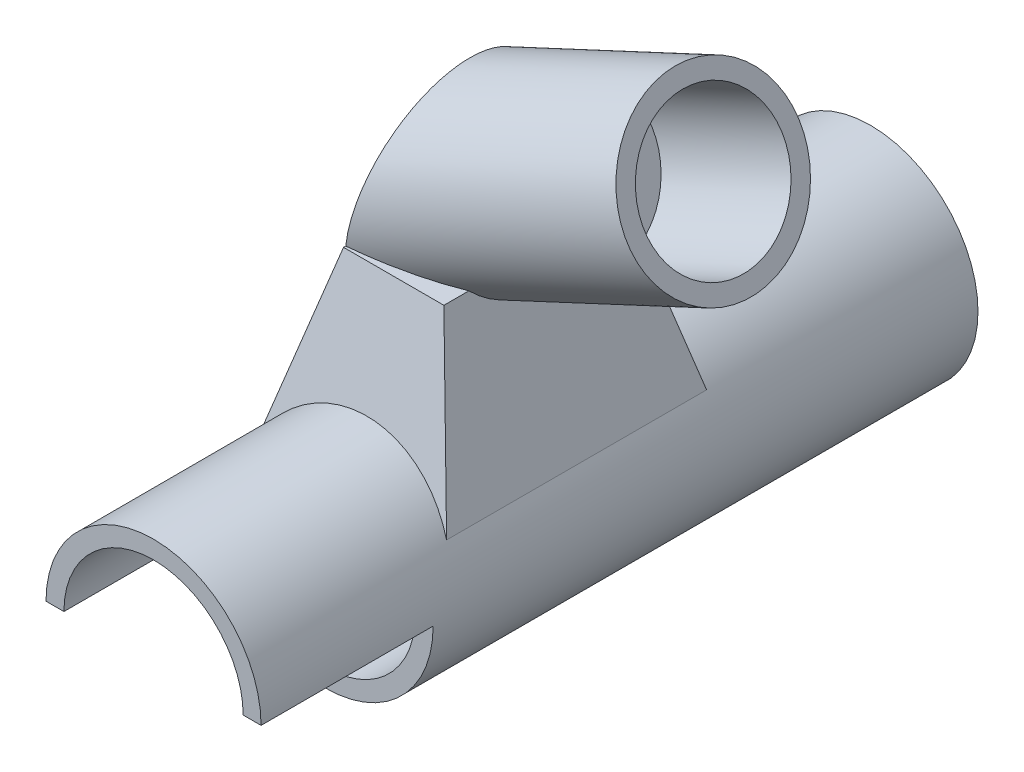
ISO-10303-21;
HEADER;
FILE_DESCRIPTION(('STEP AP214'),'2;1');
FILE_NAME('part.step','',(''),(''),'','','');
FILE_SCHEMA(('AUTOMOTIVE_DESIGN { 1 0 10303 214 1 1 1 1 }'));
ENDSEC;
DATA;
#1=APPLICATION_CONTEXT('core data for automotive mechanical design processes');
#2=APPLICATION_PROTOCOL_DEFINITION('international standard','automotive_design',2000,#1);
#3=PRODUCT_CONTEXT('',#1,'mechanical');
#4=PRODUCT('Part','Part','',(#3));
#5=PRODUCT_RELATED_PRODUCT_CATEGORY('part','',(#4));
#6=PRODUCT_DEFINITION_FORMATION('','',#4);
#7=PRODUCT_DEFINITION_CONTEXT('part definition',#1,'design');
#8=PRODUCT_DEFINITION('design','',#6,#7);
#9=PRODUCT_DEFINITION_SHAPE('','',#8);
#10=(LENGTH_UNIT() NAMED_UNIT(*) SI_UNIT(.MILLI.,.METRE.));
#11=(NAMED_UNIT(*) PLANE_ANGLE_UNIT() SI_UNIT($,.RADIAN.));
#12=(NAMED_UNIT(*) SI_UNIT($,.STERADIAN.) SOLID_ANGLE_UNIT());
#13=UNCERTAINTY_MEASURE_WITH_UNIT(LENGTH_MEASURE(1.E-05),#10,'distance_accuracy_value','');
#14=(GEOMETRIC_REPRESENTATION_CONTEXT(3) GLOBAL_UNCERTAINTY_ASSIGNED_CONTEXT((#13)) GLOBAL_UNIT_ASSIGNED_CONTEXT((#10,
#11,#12)) REPRESENTATION_CONTEXT('',''));
#15=CARTESIAN_POINT('',(0.,0.,0.));
#16=DIRECTION('',(0.,0.,1.));
#17=DIRECTION('',(1.,0.,0.));
#18=AXIS2_PLACEMENT_3D('',#15,#16,#17);
#19=CARTESIAN_POINT('',(0.,0.,154.));
#20=DIRECTION('',(0.,0.,-1.));
#21=DIRECTION('',(1.,0.,0.));
#22=AXIS2_PLACEMENT_3D('',#19,#20,#21);
#23=CYLINDRICAL_SURFACE('',#22,15.);
#24=CARTESIAN_POINT('',(0.,0.,54.));
#25=DIRECTION('',(0.,0.,1.));
#26=DIRECTION('',(1.,0.,0.));
#27=AXIS2_PLACEMENT_3D('',#24,#25,#26);
#28=CIRCLE('',#27,15.);
#29=CARTESIAN_POINT('',(15.,0.,54.));
#30=VERTEX_POINT('',#29);
#31=EDGE_CURVE('E327',#30,#30,#28,.T.);
#32=ORIENTED_EDGE('',*,*,#31,.T.);
#33=EDGE_LOOP('',(#32));
#34=FACE_BOUND('',#33,.T.);
#35=CARTESIAN_POINT('',(0.,0.,88.));
#36=DIRECTION('',(0.,0.242535625036333,-0.970142500145332));
#37=DIRECTION('',(0.,-0.970142500145332,-0.242535625036333));
#38=AXIS2_PLACEMENT_3D('',#35,#36,#37);
#39=ELLIPSE('',#38,15.4616460960662,15.);
#40=CARTESIAN_POINT('',(13.0082987551867,7.4688796680498,89.8672199170124));
#41=VERTEX_POINT('',#40);
#42=CARTESIAN_POINT('',(-13.0082987551867,7.4688796680498,89.8672199170124));
#43=VERTEX_POINT('',#42);
#44=EDGE_CURVE('E365',#41,#43,#39,.F.);
#45=ORIENTED_EDGE('',*,*,#44,.F.);
#46=DIRECTION('',(0.,0.,-1.));
#47=VECTOR('',#46,1.);
#48=CARTESIAN_POINT('',(13.0082987551867,7.4688796680498,154.));
#49=LINE('',#48,#47);
#50=CARTESIAN_POINT('',(13.0082987551867,7.4688796680498,126.132780082988));
#51=VERTEX_POINT('',#50);
#52=EDGE_CURVE('E369',#51,#41,#49,.T.);
#53=ORIENTED_EDGE('',*,*,#52,.F.);
#54=CARTESIAN_POINT('',(0.,0.,128.));
#55=DIRECTION('',(0.,0.242535625036333,0.970142500145332));
#56=DIRECTION('',(0.,0.970142500145332,-0.242535625036333));
#57=AXIS2_PLACEMENT_3D('',#54,#55,#56);
#58=ELLIPSE('',#57,15.4616460960662,15.);
#59=CARTESIAN_POINT('',(-13.0082987551867,7.46887966804979,126.132780082988));
#60=VERTEX_POINT('',#59);
#61=EDGE_CURVE('E375',#60,#51,#58,.F.);
#62=ORIENTED_EDGE('',*,*,#61,.F.);
#63=DIRECTION('',(0.,0.,-1.));
#64=VECTOR('',#63,1.);
#65=CARTESIAN_POINT('',(-13.0082987551867,7.46887966804975,154.));
#66=LINE('',#65,#64);
#67=EDGE_CURVE('E57',#43,#60,#66,.F.);
#68=ORIENTED_EDGE('',*,*,#67,.F.);
#69=EDGE_LOOP('',(#45,#53,#62,#68));
#70=FACE_BOUND('',#69,.T.);
#71=CARTESIAN_POINT('',(0.,0.,154.));
#72=DIRECTION('',(0.,0.,1.));
#73=DIRECTION('',(1.,0.,0.));
#74=AXIS2_PLACEMENT_3D('',#71,#72,#73);
#75=CIRCLE('',#74,15.);
#76=CARTESIAN_POINT('',(15.,0.,154.));
#77=VERTEX_POINT('',#76);
#78=CARTESIAN_POINT('',(-15.,0.,154.));
#79=VERTEX_POINT('',#78);
#80=EDGE_CURVE('E329',#77,#79,#75,.T.);
#81=ORIENTED_EDGE('',*,*,#80,.F.);
#82=DIRECTION('',(0.,0.,1.));
#83=VECTOR('',#82,1.);
#84=CARTESIAN_POINT('',(15.,0.,130.));
#85=LINE('',#84,#83);
#86=CARTESIAN_POINT('',(15.,0.,130.));
#87=VERTEX_POINT('',#86);
#88=EDGE_CURVE('E144',#87,#77,#85,.T.);
#89=ORIENTED_EDGE('',*,*,#88,.F.);
#90=CARTESIAN_POINT('',(0.,0.,130.));
#91=DIRECTION('',(0.,0.,-1.));
#92=DIRECTION('',(-1.,0.,0.));
#93=AXIS2_PLACEMENT_3D('',#90,#91,#92);
#94=CIRCLE('',#93,15.);
#95=CARTESIAN_POINT('',(-15.,0.,130.));
#96=VERTEX_POINT('',#95);
#97=EDGE_CURVE('E132',#87,#96,#94,.T.);
#98=ORIENTED_EDGE('',*,*,#97,.T.);
#99=DIRECTION('',(0.,0.,1.));
#100=VECTOR('',#99,1.);
#101=CARTESIAN_POINT('',(-15.,0.,130.));
#102=LINE('',#101,#100);
#103=EDGE_CURVE('E161',#96,#79,#102,.T.);
#104=ORIENTED_EDGE('',*,*,#103,.T.);
#105=EDGE_LOOP('',(#81,#89,#98,#104));
#106=FACE_BOUND('',#105,.T.);
#107=ADVANCED_FACE('F48',(#34,#70,#106),#23,.T.);
#108=CARTESIAN_POINT('',(0.,0.,154.));
#109=DIRECTION('',(0.,0.,-1.));
#110=DIRECTION('',(1.,0.,0.));
#111=AXIS2_PLACEMENT_3D('',#108,#109,#110);
#112=PLANE('',#111);
#113=DIRECTION('',(-1.,0.,0.));
#114=VECTOR('',#113,1.);
#115=CARTESIAN_POINT('',(0.,0.,154.));
#116=LINE('',#115,#114);
#117=CARTESIAN_POINT('',(-12.5,0.,154.));
#118=VERTEX_POINT('',#117);
#119=EDGE_CURVE('E148',#118,#79,#116,.T.);
#120=ORIENTED_EDGE('',*,*,#119,.F.);
#121=CARTESIAN_POINT('',(0.,0.,154.));
#122=DIRECTION('',(0.,0.,-1.));
#123=DIRECTION('',(-1.,0.,0.));
#124=AXIS2_PLACEMENT_3D('',#121,#122,#123);
#125=CIRCLE('',#124,12.5);
#126=CARTESIAN_POINT('',(12.5,0.,154.));
#127=VERTEX_POINT('',#126);
#128=EDGE_CURVE('E160',#118,#127,#125,.T.);
#129=ORIENTED_EDGE('',*,*,#128,.T.);
#130=DIRECTION('',(1.,0.,0.));
#131=VECTOR('',#130,1.);
#132=CARTESIAN_POINT('',(0.,0.,154.));
#133=LINE('',#132,#131);
#134=EDGE_CURVE('E140',#127,#77,#133,.T.);
#135=ORIENTED_EDGE('',*,*,#134,.T.);
#136=ORIENTED_EDGE('',*,*,#80,.T.);
#137=EDGE_LOOP('',(#120,#129,#135,#136));
#138=FACE_BOUND('',#137,.T.);
#139=ADVANCED_FACE('F353',(#138),#112,.F.);
#140=CARTESIAN_POINT('',(0.,0.,58.9999999999999));
#141=DIRECTION('',(0.,0.,1.));
#142=DIRECTION('',(-1.,0.,0.));
#143=AXIS2_PLACEMENT_3D('',#140,#141,#142);
#144=CYLINDRICAL_SURFACE('',#143,12.5);
#145=CARTESIAN_POINT('',(0.,0.,58.9999999999999));
#146=DIRECTION('',(0.,0.,-1.));
#147=DIRECTION('',(-1.,0.,0.));
#148=AXIS2_PLACEMENT_3D('',#145,#146,#147);
#149=CIRCLE('',#148,12.5);
#150=CARTESIAN_POINT('',(-12.5,0.,58.9999999999999));
#151=VERTEX_POINT('',#150);
#152=EDGE_CURVE('E165',#151,#151,#149,.T.);
#153=ORIENTED_EDGE('',*,*,#152,.T.);
#154=EDGE_LOOP('',(#153));
#155=FACE_BOUND('',#154,.T.);
#156=DIRECTION('',(0.,0.,1.));
#157=VECTOR('',#156,1.);
#158=CARTESIAN_POINT('',(-12.5,0.,130.));
#159=LINE('',#158,#157);
#160=CARTESIAN_POINT('',(-12.5,0.,130.));
#161=VERTEX_POINT('',#160);
#162=EDGE_CURVE('E147',#161,#118,#159,.T.);
#163=ORIENTED_EDGE('',*,*,#162,.F.);
#164=CARTESIAN_POINT('',(0.,0.,130.));
#165=DIRECTION('',(0.,0.,-1.));
#166=DIRECTION('',(-1.,0.,0.));
#167=AXIS2_PLACEMENT_3D('',#164,#165,#166);
#168=CIRCLE('',#167,12.5);
#169=CARTESIAN_POINT('',(12.5,0.,130.));
#170=VERTEX_POINT('',#169);
#171=EDGE_CURVE('E129',#170,#161,#168,.T.);
#172=ORIENTED_EDGE('',*,*,#171,.F.);
#173=DIRECTION('',(0.,0.,1.));
#174=VECTOR('',#173,1.);
#175=CARTESIAN_POINT('',(12.5,0.,130.));
#176=LINE('',#175,#174);
#177=EDGE_CURVE('E138',#170,#127,#176,.T.);
#178=ORIENTED_EDGE('',*,*,#177,.T.);
#179=ORIENTED_EDGE('',*,*,#128,.F.);
#180=EDGE_LOOP('',(#163,#172,#178,#179));
#181=FACE_BOUND('',#180,.T.);
#182=ADVANCED_FACE('F146',(#155,#181),#144,.F.);
#183=CARTESIAN_POINT('',(0.,30.,108.));
#184=DIRECTION('',(0.,1.,0.));
#185=DIRECTION('',(0.,0.,-1.));
#186=AXIS2_PLACEMENT_3D('',#183,#184,#185);
#187=PLANE('',#186);
#188=CARTESIAN_POINT('',(-13.4936044314027,30.,108.));
#189=DIRECTION('',(0.,-1.,0.));
#190=DIRECTION('',(1.,0.,0.));
#191=AXIS2_PLACEMENT_3D('',#188,#189,#190);
#192=ELLIPSE('',#191,29.5775197894062,12.5);
#193=CARTESIAN_POINT('',(7.,30.,117.013188836083));
#194=VERTEX_POINT('',#193);
#195=CARTESIAN_POINT('',(-7.00000000000001,30.,120.195028933762));
#196=VERTEX_POINT('',#195);
#197=EDGE_CURVE('E185',#194,#196,#192,.T.);
#198=ORIENTED_EDGE('',*,*,#197,.T.);
#199=DIRECTION('',(0.,0.,-1.));
#200=VECTOR('',#199,1.);
#201=CARTESIAN_POINT('',(-7.,30.,120.5));
#202=LINE('',#201,#200);
#203=CARTESIAN_POINT('',(-7.,30.,120.5));
#204=VERTEX_POINT('',#203);
#205=EDGE_CURVE('E326',#204,#196,#202,.T.);
#206=ORIENTED_EDGE('',*,*,#205,.F.);
#207=DIRECTION('',(-1.,0.,0.));
#208=VECTOR('',#207,1.);
#209=CARTESIAN_POINT('',(-7.,30.,120.5));
#210=LINE('',#209,#208);
#211=CARTESIAN_POINT('',(7.,30.,120.5));
#212=VERTEX_POINT('',#211);
#213=EDGE_CURVE('E217',#212,#204,#210,.T.);
#214=ORIENTED_EDGE('',*,*,#213,.F.);
#215=DIRECTION('',(0.,0.,1.));
#216=VECTOR('',#215,1.);
#217=CARTESIAN_POINT('',(7.,30.,120.5));
#218=LINE('',#217,#216);
#219=EDGE_CURVE('E200',#194,#212,#218,.T.);
#220=ORIENTED_EDGE('',*,*,#219,.F.);
#221=EDGE_LOOP('',(#198,#206,#214,#220));
#222=FACE_BOUND('',#221,.T.);
#223=ADVANCED_FACE('F304',(#222),#187,.T.);
#224=CARTESIAN_POINT('',(0.,0.,54.));
#225=DIRECTION('',(0.,0.,-1.));
#226=DIRECTION('',(1.,0.,0.));
#227=AXIS2_PLACEMENT_3D('',#224,#225,#226);
#228=PLANE('',#227);
#229=CARTESIAN_POINT('',(2.172182,-4.20172885356445,54.));
#230=DIRECTION('',(0.,0.,1.));
#231=DIRECTION('',(1.,0.,0.));
#232=AXIS2_PLACEMENT_3D('',#229,#230,#231);
#233=CIRCLE('',#232,2.435);
#234=CARTESIAN_POINT('',(4.607182,-4.20172885356445,54.));
#235=VERTEX_POINT('',#234);
#236=EDGE_CURVE('E157',#235,#235,#233,.T.);
#237=ORIENTED_EDGE('',*,*,#236,.T.);
#238=EDGE_LOOP('',(#237));
#239=FACE_BOUND('',#238,.T.);
#240=ORIENTED_EDGE('',*,*,#31,.F.);
#241=EDGE_LOOP('',(#240));
#242=FACE_BOUND('',#241,.T.);
#243=ADVANCED_FACE('F303',(#239,#242),#228,.T.);
#244=CARTESIAN_POINT('',(-7.,30.,95.8049710662379));
#245=VERTEX_POINT('',#244);
#246=CARTESIAN_POINT('',(7.,30.,98.9868111639168));
#247=VERTEX_POINT('',#246);
#248=EDGE_CURVE('E182',#245,#247,#192,.T.);
#249=ORIENTED_EDGE('',*,*,#248,.T.);
#250=CARTESIAN_POINT('',(7.,30.,95.5));
#251=VERTEX_POINT('',#250);
#252=EDGE_CURVE('E259',#251,#247,#218,.T.);
#253=ORIENTED_EDGE('',*,*,#252,.F.);
#254=DIRECTION('',(1.,0.,0.));
#255=VECTOR('',#254,1.);
#256=CARTESIAN_POINT('',(-7.,30.,95.5));
#257=LINE('',#256,#255);
#258=CARTESIAN_POINT('',(-7.,30.,95.5));
#259=VERTEX_POINT('',#258);
#260=EDGE_CURVE('E316',#259,#251,#257,.T.);
#261=ORIENTED_EDGE('',*,*,#260,.F.);
#262=EDGE_CURVE('E51',#245,#259,#202,.T.);
#263=ORIENTED_EDGE('',*,*,#262,.F.);
#264=EDGE_LOOP('',(#249,#253,#261,#263));
#265=FACE_BOUND('',#264,.T.);
#266=ADVANCED_FACE('F294',(#265),#187,.T.);
#267=CARTESIAN_POINT('',(-14.0041493775934,3.7344398340249,108.));
#268=DIRECTION('',(0.966234939601246,-0.257662650560333,0.));
#269=DIRECTION('',(0.257662650560333,0.966234939601246,0.));
#270=AXIS2_PLACEMENT_3D('',#267,#268,#269);
#271=PLANE('',#270);
#272=ORIENTED_EDGE('',*,*,#262,.T.);
#273=DIRECTION('',(0.250459024806617,0.939221343024814,0.234805335756204));
#274=VECTOR('',#273,1.);
#275=CARTESIAN_POINT('',(-15.,0.,88.));
#276=LINE('',#275,#274);
#277=EDGE_CURVE('E191',#43,#259,#276,.T.);
#278=ORIENTED_EDGE('',*,*,#277,.F.);
#279=ORIENTED_EDGE('',*,*,#67,.T.);
#280=DIRECTION('',(0.250459024806617,0.939221343024814,-0.234805335756204));
#281=VECTOR('',#280,1.);
#282=CARTESIAN_POINT('',(-15.,0.,128.));
#283=LINE('',#282,#281);
#284=EDGE_CURVE('E208',#60,#204,#283,.T.);
#285=ORIENTED_EDGE('',*,*,#284,.T.);
#286=ORIENTED_EDGE('',*,*,#205,.T.);
#287=CARTESIAN_POINT('',(-6.07786200406005,33.4580174847748,108.));
#288=DIRECTION('',(-0.966234939601246,0.257662650560333,0.));
#289=DIRECTION('',(0.257662650560333,0.966234939601246,0.));
#290=AXIS2_PLACEMENT_3D('',#287,#288,#289);
#291=ELLIPSE('',#290,16.3012298606754,12.5);
#292=EDGE_CURVE('E178',#245,#196,#291,.F.);
#293=ORIENTED_EDGE('',*,*,#292,.F.);
#294=EDGE_LOOP('',(#272,#278,#279,#285,#286,#293));
#295=FACE_BOUND('',#294,.T.);
#296=ADVANCED_FACE('F236',(#295),#271,.F.);
#297=CARTESIAN_POINT('',(0.,4.70588235294118,126.823529411765));
#298=DIRECTION('',(0.,-0.242535625036333,-0.970142500145332));
#299=DIRECTION('',(0.,-0.970142500145332,0.242535625036333));
#300=AXIS2_PLACEMENT_3D('',#297,#298,#299);
#301=PLANE('',#300);
#302=ORIENTED_EDGE('',*,*,#61,.T.);
#303=DIRECTION('',(-0.250459024806617,0.939221343024814,-0.234805335756204));
#304=VECTOR('',#303,1.);
#305=CARTESIAN_POINT('',(15.,0.,128.));
#306=LINE('',#305,#304);
#307=EDGE_CURVE('E197',#51,#212,#306,.T.);
#308=ORIENTED_EDGE('',*,*,#307,.T.);
#309=ORIENTED_EDGE('',*,*,#213,.T.);
#310=ORIENTED_EDGE('',*,*,#284,.F.);
#311=EDGE_LOOP('',(#302,#308,#309,#310));
#312=FACE_BOUND('',#311,.T.);
#313=ADVANCED_FACE('F225',(#312),#301,.F.);
#314=CARTESIAN_POINT('',(0.,4.70588235294118,89.1764705882353));
#315=DIRECTION('',(0.,-0.242535625036333,0.970142500145332));
#316=DIRECTION('',(0.,0.970142500145332,0.242535625036333));
#317=AXIS2_PLACEMENT_3D('',#314,#315,#316);
#318=PLANE('',#317);
#319=ORIENTED_EDGE('',*,*,#44,.T.);
#320=ORIENTED_EDGE('',*,*,#277,.T.);
#321=ORIENTED_EDGE('',*,*,#260,.T.);
#322=DIRECTION('',(-0.250459024806617,0.939221343024814,0.234805335756204));
#323=VECTOR('',#322,1.);
#324=CARTESIAN_POINT('',(15.,0.,88.));
#325=LINE('',#324,#323);
#326=EDGE_CURVE('E201',#41,#251,#325,.T.);
#327=ORIENTED_EDGE('',*,*,#326,.F.);
#328=EDGE_LOOP('',(#319,#320,#321,#327));
#329=FACE_BOUND('',#328,.T.);
#330=ADVANCED_FACE('F235',(#329),#318,.F.);
#331=CARTESIAN_POINT('',(14.0041493775934,3.7344398340249,108.));
#332=DIRECTION('',(-0.966234939601246,-0.257662650560332,0.));
#333=DIRECTION('',(0.257662650560332,-0.966234939601246,0.));
#334=AXIS2_PLACEMENT_3D('',#331,#332,#333);
#335=PLANE('',#334);
#336=ORIENTED_EDGE('',*,*,#219,.T.);
#337=ORIENTED_EDGE('',*,*,#307,.F.);
#338=ORIENTED_EDGE('',*,*,#52,.T.);
#339=ORIENTED_EDGE('',*,*,#326,.T.);
#340=ORIENTED_EDGE('',*,*,#252,.T.);
#341=CARTESIAN_POINT('',(4.73348496733181,38.4994313725057,108.));
#342=DIRECTION('',(0.966234939601246,0.257662650560332,0.));
#343=DIRECTION('',(-0.257662650560332,0.966234939601246,0.));
#344=AXIS2_PLACEMENT_3D('',#341,#342,#343);
#345=ELLIPSE('',#344,12.6955212939983,12.5);
#346=EDGE_CURVE('E12',#194,#247,#345,.T.);
#347=ORIENTED_EDGE('',*,*,#346,.F.);
#348=EDGE_LOOP('',(#336,#337,#338,#339,#340,#347));
#349=FACE_BOUND('',#348,.T.);
#350=ADVANCED_FACE('F242',(#349),#335,.F.);
#351=CARTESIAN_POINT('',(-42.9927659385992,16.2443150800431,108.));
#352=DIRECTION('',(0.906307787036649,0.4226182617407,0.));
#353=DIRECTION('',(-0.422618261740701,0.90630778703665,0.));
#354=AXIS2_PLACEMENT_3D('',#351,#352,#353);
#355=CYLINDRICAL_SURFACE('',#354,12.5);
#356=ORIENTED_EDGE('',*,*,#346,.T.);
#357=ORIENTED_EDGE('',*,*,#248,.F.);
#358=ORIENTED_EDGE('',*,*,#292,.T.);
#359=ORIENTED_EDGE('',*,*,#197,.F.);
#360=EDGE_LOOP('',(#356,#357,#358,#359));
#361=FACE_BOUND('',#360,.T.);
#362=CARTESIAN_POINT('',(32.065513698419,51.2445656827242,108.));
#363=DIRECTION('',(-0.906307787036649,-0.422618261740701,0.));
#364=DIRECTION('',(-0.422618261740701,0.906307787036649,0.));
#365=AXIS2_PLACEMENT_3D('',#362,#363,#364);
#366=CIRCLE('',#365,12.5);
#367=CARTESIAN_POINT('',(26.7827854266603,62.5734130206823,108.));
#368=VERTEX_POINT('',#367);
#369=EDGE_CURVE('E173',#368,#368,#366,.T.);
#370=ORIENTED_EDGE('',*,*,#369,.T.);
#371=EDGE_LOOP('',(#370));
#372=FACE_BOUND('',#371,.T.);
#373=ADVANCED_FACE('F336',(#361,#372),#355,.T.);
#374=CARTESIAN_POINT('',(45.9662216916466,21.4344011912653,108.));
#375=DIRECTION('',(0.906307787036649,0.422618261740701,0.));
#376=DIRECTION('',(-0.422618261740701,0.906307787036649,0.));
#377=AXIS2_PLACEMENT_3D('',#374,#375,#376);
#378=PLANE('',#377);
#379=CARTESIAN_POINT('',(32.065513698419,51.2445656827242,108.));
#380=DIRECTION('',(-0.906307787036649,-0.422618261740701,0.));
#381=DIRECTION('',(-0.422618261740701,0.906307787036649,0.));
#382=AXIS2_PLACEMENT_3D('',#379,#380,#381);
#383=CIRCLE('',#382,10.);
#384=CARTESIAN_POINT('',(27.839331081012,60.3076435530907,108.));
#385=VERTEX_POINT('',#384);
#386=EDGE_CURVE('E168',#385,#385,#383,.T.);
#387=ORIENTED_EDGE('',*,*,#386,.T.);
#388=EDGE_LOOP('',(#387));
#389=FACE_BOUND('',#388,.T.);
#390=ORIENTED_EDGE('',*,*,#369,.F.);
#391=EDGE_LOOP('',(#390));
#392=FACE_BOUND('',#391,.T.);
#393=ADVANCED_FACE('F339',(#389,#392),#378,.T.);
#394=CARTESIAN_POINT('',(13.9393579576861,42.7922004479102,108.));
#395=DIRECTION('',(0.906307787036649,0.422618261740701,0.));
#396=DIRECTION('',(-0.422618261740701,0.906307787036649,0.));
#397=AXIS2_PLACEMENT_3D('',#394,#395,#396);
#398=CYLINDRICAL_SURFACE('',#397,10.);
#399=CARTESIAN_POINT('',(13.9393579576861,42.7922004479102,108.));
#400=DIRECTION('',(-0.906307787036649,-0.422618261740701,0.));
#401=DIRECTION('',(-0.422618261740701,0.906307787036649,0.));
#402=AXIS2_PLACEMENT_3D('',#399,#400,#401);
#403=CIRCLE('',#402,10.);
#404=CARTESIAN_POINT('',(9.71317534027905,51.8552783182767,108.));
#405=VERTEX_POINT('',#404);
#406=EDGE_CURVE('E170',#405,#405,#403,.T.);
#407=ORIENTED_EDGE('',*,*,#406,.T.);
#408=EDGE_LOOP('',(#407));
#409=FACE_BOUND('',#408,.T.);
#410=ORIENTED_EDGE('',*,*,#386,.F.);
#411=EDGE_LOOP('',(#410));
#412=FACE_BOUND('',#411,.T.);
#413=ADVANCED_FACE('F343',(#409,#412),#398,.F.);
#414=CARTESIAN_POINT('',(27.8400659509136,12.9820359564513,108.));
#415=DIRECTION('',(0.906307787036649,0.422618261740701,0.));
#416=DIRECTION('',(-0.422618261740701,0.906307787036649,0.));
#417=AXIS2_PLACEMENT_3D('',#414,#415,#416);
#418=PLANE('',#417);
#419=ORIENTED_EDGE('',*,*,#406,.F.);
#420=EDGE_LOOP('',(#419));
#421=FACE_BOUND('',#420,.T.);
#422=ADVANCED_FACE('F349',(#421),#418,.T.);
#423=CARTESIAN_POINT('',(0.,0.,58.9999999999999));
#424=DIRECTION('',(0.,0.,1.));
#425=DIRECTION('',(-1.,0.,0.));
#426=AXIS2_PLACEMENT_3D('',#423,#424,#425);
#427=PLANE('',#426);
#428=CARTESIAN_POINT('',(2.172182,-4.20172885356445,59.));
#429=DIRECTION('',(0.,0.,-1.));
#430=DIRECTION('',(-1.,0.,0.));
#431=AXIS2_PLACEMENT_3D('',#428,#429,#430);
#432=CIRCLE('',#431,2.435);
#433=CARTESIAN_POINT('',(-0.262818,-4.20172885356445,59.));
#434=VERTEX_POINT('',#433);
#435=EDGE_CURVE('E152',#434,#434,#432,.F.);
#436=ORIENTED_EDGE('',*,*,#435,.F.);
#437=EDGE_LOOP('',(#436));
#438=FACE_BOUND('',#437,.T.);
#439=ORIENTED_EDGE('',*,*,#152,.F.);
#440=EDGE_LOOP('',(#439));
#441=FACE_BOUND('',#440,.T.);
#442=ADVANCED_FACE('F406',(#438,#441),#427,.T.);
#443=CARTESIAN_POINT('',(0.,0.,130.));
#444=DIRECTION('',(0.,-1.,0.));
#445=DIRECTION('',(0.,0.,1.));
#446=AXIS2_PLACEMENT_3D('',#443,#444,#445);
#447=PLANE('',#446);
#448=ORIENTED_EDGE('',*,*,#119,.T.);
#449=ORIENTED_EDGE('',*,*,#103,.F.);
#450=DIRECTION('',(-1.,0.,0.));
#451=VECTOR('',#450,1.);
#452=CARTESIAN_POINT('',(0.,0.,130.));
#453=LINE('',#452,#451);
#454=EDGE_CURVE('E65',#161,#96,#453,.T.);
#455=ORIENTED_EDGE('',*,*,#454,.F.);
#456=ORIENTED_EDGE('',*,*,#162,.T.);
#457=EDGE_LOOP('',(#448,#449,#455,#456));
#458=FACE_BOUND('',#457,.T.);
#459=ADVANCED_FACE('F416',(#458),#447,.T.);
#460=CARTESIAN_POINT('',(0.,0.,130.));
#461=DIRECTION('',(0.,1.,0.));
#462=DIRECTION('',(0.,0.,-1.));
#463=AXIS2_PLACEMENT_3D('',#460,#461,#462);
#464=PLANE('',#463);
#465=ORIENTED_EDGE('',*,*,#134,.F.);
#466=ORIENTED_EDGE('',*,*,#177,.F.);
#467=DIRECTION('',(1.,0.,0.));
#468=VECTOR('',#467,1.);
#469=CARTESIAN_POINT('',(0.,0.,130.));
#470=LINE('',#469,#468);
#471=EDGE_CURVE('E125',#170,#87,#470,.T.);
#472=ORIENTED_EDGE('',*,*,#471,.T.);
#473=ORIENTED_EDGE('',*,*,#88,.T.);
#474=EDGE_LOOP('',(#465,#466,#472,#473));
#475=FACE_BOUND('',#474,.T.);
#476=ADVANCED_FACE('F139',(#475),#464,.F.);
#477=CARTESIAN_POINT('',(0.,0.,130.));
#478=DIRECTION('',(0.,0.,1.));
#479=DIRECTION('',(-1.,0.,0.));
#480=AXIS2_PLACEMENT_3D('',#477,#478,#479);
#481=PLANE('',#480);
#482=ORIENTED_EDGE('',*,*,#171,.T.);
#483=ORIENTED_EDGE('',*,*,#454,.T.);
#484=ORIENTED_EDGE('',*,*,#97,.F.);
#485=ORIENTED_EDGE('',*,*,#471,.F.);
#486=EDGE_LOOP('',(#482,#483,#484,#485));
#487=FACE_BOUND('',#486,.T.);
#488=ADVANCED_FACE('F127',(#487),#481,.T.);
#489=CARTESIAN_POINT('',(2.172182,-4.20172885356445,154.001));
#490=DIRECTION('',(0.,0.,-1.));
#491=DIRECTION('',(1.,0.,0.));
#492=AXIS2_PLACEMENT_3D('',#489,#490,#491);
#493=CYLINDRICAL_SURFACE('',#492,2.435);
#494=ORIENTED_EDGE('',*,*,#435,.T.);
#495=EDGE_LOOP('',(#494));
#496=FACE_BOUND('',#495,.T.);
#497=ORIENTED_EDGE('',*,*,#236,.F.);
#498=EDGE_LOOP('',(#497));
#499=FACE_BOUND('',#498,.T.);
#500=ADVANCED_FACE('F442',(#496,#499),#493,.F.);
#501=CLOSED_SHELL('',(#107,#139,#182,#223,#243,#266,#296,#313,#330,#350,#373,#393,#413,#422,
#442,#459,#476,#488,#500));
#502=MANIFOLD_SOLID_BREP('B2',#501);
#503=ADVANCED_BREP_SHAPE_REPRESENTATION('',(#18,#502),#14);
#504=SHAPE_DEFINITION_REPRESENTATION(#9,#503);
ENDSEC;
END-ISO-10303-21;
